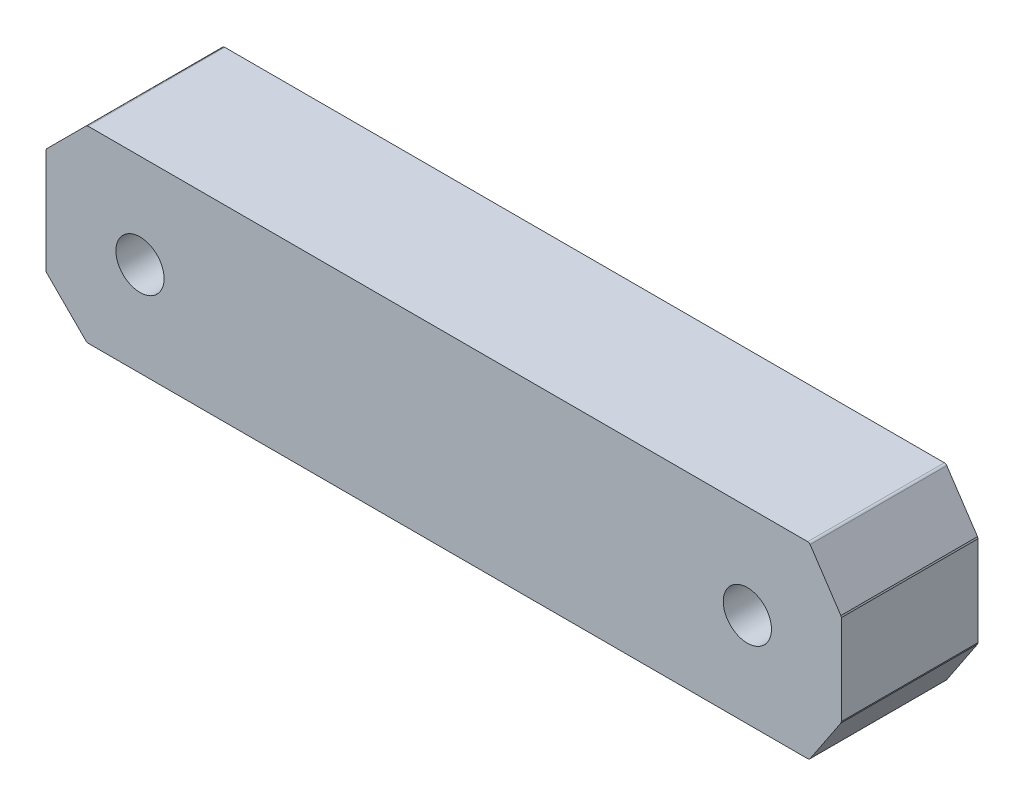
ISO-10303-21;
HEADER;
FILE_DESCRIPTION(('STEP AP214'),'2;1');
FILE_NAME('part.step','',(''),(''),'','','');
FILE_SCHEMA(('AUTOMOTIVE_DESIGN { 1 0 10303 214 1 1 1 1 }'));
ENDSEC;
DATA;
#1=APPLICATION_CONTEXT('core data for automotive mechanical design processes');
#2=APPLICATION_PROTOCOL_DEFINITION('international standard','automotive_design',2000,#1);
#3=PRODUCT_CONTEXT('',#1,'mechanical');
#4=PRODUCT('Part','Part','',(#3));
#5=PRODUCT_RELATED_PRODUCT_CATEGORY('part','',(#4));
#6=PRODUCT_DEFINITION_FORMATION('','',#4);
#7=PRODUCT_DEFINITION_CONTEXT('part definition',#1,'design');
#8=PRODUCT_DEFINITION('design','',#6,#7);
#9=PRODUCT_DEFINITION_SHAPE('','',#8);
#10=(LENGTH_UNIT() NAMED_UNIT(*) SI_UNIT(.MILLI.,.METRE.));
#11=(NAMED_UNIT(*) PLANE_ANGLE_UNIT() SI_UNIT($,.RADIAN.));
#12=(NAMED_UNIT(*) SI_UNIT($,.STERADIAN.) SOLID_ANGLE_UNIT());
#13=UNCERTAINTY_MEASURE_WITH_UNIT(LENGTH_MEASURE(1.E-05),#10,'distance_accuracy_value','');
#14=(GEOMETRIC_REPRESENTATION_CONTEXT(3) GLOBAL_UNCERTAINTY_ASSIGNED_CONTEXT((#13)) GLOBAL_UNIT_ASSIGNED_CONTEXT((#10,
#11,#12)) REPRESENTATION_CONTEXT('',''));
#15=CARTESIAN_POINT('',(0.,0.,0.));
#16=DIRECTION('',(0.,0.,1.));
#17=DIRECTION('',(1.,0.,0.));
#18=AXIS2_PLACEMENT_3D('',#15,#16,#17);
#19=CARTESIAN_POINT('',(-24.588730162779,-6.29999999999995,9.45));
#20=DIRECTION('',(0.,0.,1.));
#21=DIRECTION('',(1.,0.,0.));
#22=AXIS2_PLACEMENT_3D('',#19,#20,#21);
#23=PLANE('',#22);
#24=CARTESIAN_POINT('',(20.9999999999963,1.73120384385851E-12,9.45));
#25=DIRECTION('',(0.,0.,1.));
#26=DIRECTION('',(1.,0.,0.));
#27=AXIS2_PLACEMENT_3D('',#24,#25,#26);
#28=CIRCLE('',#27,1.666);
#29=CARTESIAN_POINT('',(22.6659999999963,1.73120384385851E-12,9.45));
#30=VERTEX_POINT('',#29);
#31=EDGE_CURVE('E182',#30,#30,#28,.T.);
#32=ORIENTED_EDGE('',*,*,#31,.F.);
#33=EDGE_LOOP('',(#32));
#34=FACE_BOUND('',#33,.T.);
#35=CARTESIAN_POINT('',(-24.588730162779,-6.29999999999995,9.45));
#36=DIRECTION('',(0.,0.,1.));
#37=DIRECTION('',(1.,0.,0.));
#38=AXIS2_PLACEMENT_3D('',#35,#36,#37);
#39=CIRCLE('',#38,0.200000000000001);
#40=CARTESIAN_POINT('',(-24.7301515190163,-6.44142135623726,9.45));
#41=VERTEX_POINT('',#40);
#42=CARTESIAN_POINT('',(-24.588730162779,-6.49999999999995,9.45));
#43=VERTEX_POINT('',#42);
#44=EDGE_CURVE('E209',#41,#43,#39,.T.);
#45=ORIENTED_EDGE('',*,*,#44,.T.);
#46=DIRECTION('',(1.,0.,0.));
#47=VECTOR('',#46,1.);
#48=CARTESIAN_POINT('',(-24.588730162779,-6.49999999999995,9.45));
#49=LINE('',#48,#47);
#50=CARTESIAN_POINT('',(25.174488320499,-6.49999999999995,9.45));
#51=VERTEX_POINT('',#50);
#52=EDGE_CURVE('E117',#43,#51,#49,.T.);
#53=ORIENTED_EDGE('',*,*,#52,.T.);
#54=CARTESIAN_POINT('',(25.174488320499,-6.29999999999995,9.45));
#55=DIRECTION('',(0.,0.,1.));
#56=DIRECTION('',(1.,0.,0.));
#57=AXIS2_PLACEMENT_3D('',#54,#55,#56);
#58=CIRCLE('',#57,0.2);
#59=CARTESIAN_POINT('',(25.3409096767364,-6.41092309132063,9.45));
#60=VERTEX_POINT('',#59);
#61=EDGE_CURVE('E248',#51,#60,#58,.T.);
#62=ORIENTED_EDGE('',*,*,#61,.T.);
#63=DIRECTION('',(0.554615456603367,0.832106781186549,0.));
#64=VECTOR('',#63,1.);
#65=CARTESIAN_POINT('',(27.4664213562375,-3.22195195655291,9.45));
#66=LINE('',#65,#64);
#67=CARTESIAN_POINT('',(27.4664213562375,-3.22195195655291,9.45));
#68=VERTEX_POINT('',#67);
#69=EDGE_CURVE('E267',#60,#68,#66,.T.);
#70=ORIENTED_EDGE('',*,*,#69,.T.);
#71=DIRECTION('',(0.289735412759155,0.957106781186552,0.));
#72=VECTOR('',#71,1.);
#73=CARTESIAN_POINT('',(27.4664213562375,-3.22195195655291,9.45));
#74=LINE('',#73,#72);
#75=CARTESIAN_POINT('',(27.5000000000002,-3.11102886523224,9.45));
#76=VERTEX_POINT('',#75);
#77=EDGE_CURVE('E264',#68,#76,#74,.T.);
#78=ORIENTED_EDGE('',*,*,#77,.T.);
#79=DIRECTION('',(0.,1.,0.));
#80=VECTOR('',#79,1.);
#81=CARTESIAN_POINT('',(27.5000000000002,3.11102886523233,9.45));
#82=LINE('',#81,#80);
#83=CARTESIAN_POINT('',(27.5000000000002,3.11102886523233,9.45));
#84=VERTEX_POINT('',#83);
#85=EDGE_CURVE('E266',#76,#84,#82,.T.);
#86=ORIENTED_EDGE('',*,*,#85,.T.);
#87=DIRECTION('',(-0.289735412759156,0.957106781186551,0.));
#88=VECTOR('',#87,1.);
#89=CARTESIAN_POINT('',(27.5000000000002,3.11102886523233,9.45));
#90=LINE('',#89,#88);
#91=CARTESIAN_POINT('',(27.4664213562375,3.221951956553,9.45));
#92=VERTEX_POINT('',#91);
#93=EDGE_CURVE('E269',#84,#92,#90,.T.);
#94=ORIENTED_EDGE('',*,*,#93,.T.);
#95=DIRECTION('',(-0.554615456603367,0.832106781186549,0.));
#96=VECTOR('',#95,1.);
#97=CARTESIAN_POINT('',(25.3409096767364,6.41092309132072,9.45));
#98=LINE('',#97,#96);
#99=CARTESIAN_POINT('',(25.3409096767364,6.41092309132072,9.45));
#100=VERTEX_POINT('',#99);
#101=EDGE_CURVE('E275',#92,#100,#98,.T.);
#102=ORIENTED_EDGE('',*,*,#101,.T.);
#103=CARTESIAN_POINT('',(25.174488320499,6.30000000000005,9.45));
#104=DIRECTION('',(0.,0.,1.));
#105=DIRECTION('',(1.,0.,0.));
#106=AXIS2_PLACEMENT_3D('',#103,#104,#105);
#107=CIRCLE('',#106,0.2);
#108=CARTESIAN_POINT('',(25.174488320499,6.50000000000005,9.45));
#109=VERTEX_POINT('',#108);
#110=EDGE_CURVE('E277',#100,#109,#107,.T.);
#111=ORIENTED_EDGE('',*,*,#110,.T.);
#112=DIRECTION('',(-1.,0.,0.));
#113=VECTOR('',#112,1.);
#114=CARTESIAN_POINT('',(25.174488320499,6.50000000000005,9.45));
#115=LINE('',#114,#113);
#116=CARTESIAN_POINT('',(-24.588730162779,6.50000000000005,9.45));
#117=VERTEX_POINT('',#116);
#118=EDGE_CURVE('E279',#109,#117,#115,.T.);
#119=ORIENTED_EDGE('',*,*,#118,.T.);
#120=CARTESIAN_POINT('',(-24.588730162779,6.30000000000005,9.45));
#121=DIRECTION('',(0.,0.,1.));
#122=DIRECTION('',(1.,0.,0.));
#123=AXIS2_PLACEMENT_3D('',#120,#121,#122);
#124=CIRCLE('',#123,0.2);
#125=CARTESIAN_POINT('',(-24.7301515190163,6.44142135623736,9.45));
#126=VERTEX_POINT('',#125);
#127=EDGE_CURVE('E281',#117,#126,#124,.T.);
#128=ORIENTED_EDGE('',*,*,#127,.T.);
#129=DIRECTION('',(-0.707106781186545,-0.70710678118655,0.));
#130=VECTOR('',#129,1.);
#131=CARTESIAN_POINT('',(-27.4414213562371,3.73015151901653,9.45));
#132=LINE('',#131,#130);
#133=CARTESIAN_POINT('',(-27.4414213562371,3.73015151901653,9.45));
#134=VERTEX_POINT('',#133);
#135=EDGE_CURVE('E283',#126,#134,#132,.T.);
#136=ORIENTED_EDGE('',*,*,#135,.T.);
#137=CARTESIAN_POINT('',(-27.2999999999998,3.58873016277922,9.45));
#138=DIRECTION('',(0.,0.,1.));
#139=DIRECTION('',(1.,0.,0.));
#140=AXIS2_PLACEMENT_3D('',#137,#138,#139);
#141=CIRCLE('',#140,0.199999999999999);
#142=CARTESIAN_POINT('',(-27.4999999999998,3.58873016277923,9.45));
#143=VERTEX_POINT('',#142);
#144=EDGE_CURVE('E160',#134,#143,#141,.T.);
#145=ORIENTED_EDGE('',*,*,#144,.T.);
#146=DIRECTION('',(0.,-1.,0.));
#147=VECTOR('',#146,1.);
#148=CARTESIAN_POINT('',(-27.4999999999998,-3.58873016277913,9.45));
#149=LINE('',#148,#147);
#150=CARTESIAN_POINT('',(-27.4999999999998,-3.58873016277913,9.45));
#151=VERTEX_POINT('',#150);
#152=EDGE_CURVE('E154',#143,#151,#149,.T.);
#153=ORIENTED_EDGE('',*,*,#152,.T.);
#154=CARTESIAN_POINT('',(-27.2999999999998,-3.58873016277913,9.45));
#155=DIRECTION('',(0.,0.,1.));
#156=DIRECTION('',(1.,0.,0.));
#157=AXIS2_PLACEMENT_3D('',#154,#155,#156);
#158=CIRCLE('',#157,0.199999999999999);
#159=CARTESIAN_POINT('',(-27.4414213562371,-3.73015151901644,9.45));
#160=VERTEX_POINT('',#159);
#161=EDGE_CURVE('E158',#151,#160,#158,.T.);
#162=ORIENTED_EDGE('',*,*,#161,.T.);
#163=DIRECTION('',(0.707106781186545,-0.70710678118655,0.));
#164=VECTOR('',#163,1.);
#165=CARTESIAN_POINT('',(-24.7301515190163,-6.44142135623726,9.45));
#166=LINE('',#165,#164);
#167=EDGE_CURVE('E50',#160,#41,#166,.T.);
#168=ORIENTED_EDGE('',*,*,#167,.T.);
#169=EDGE_LOOP('',(#45,#53,#62,#70,#78,#86,#94,#102,#111,#119,#128,#136,#145,#153,#162,#168));
#170=FACE_BOUND('',#169,.T.);
#171=CARTESIAN_POINT('',(-21.0000000000037,1.23160348277719E-12,9.45));
#172=DIRECTION('',(0.,0.,1.));
#173=DIRECTION('',(1.,0.,0.));
#174=AXIS2_PLACEMENT_3D('',#171,#172,#173);
#175=CIRCLE('',#174,1.66600000000001);
#176=CARTESIAN_POINT('',(-19.3340000000037,1.23160348277719E-12,9.45));
#177=VERTEX_POINT('',#176);
#178=EDGE_CURVE('E325',#177,#177,#175,.T.);
#179=ORIENTED_EDGE('',*,*,#178,.F.);
#180=EDGE_LOOP('',(#179));
#181=FACE_BOUND('',#180,.T.);
#182=ADVANCED_FACE('F33',(#34,#170,#181),#23,.T.);
#183=CARTESIAN_POINT('',(-24.588730162779,-6.3,0.));
#184=DIRECTION('',(0.,0.,1.));
#185=DIRECTION('',(1.,0.,0.));
#186=AXIS2_PLACEMENT_3D('',#183,#184,#185);
#187=PLANE('',#186);
#188=CARTESIAN_POINT('',(-24.588730162779,-6.3,0.));
#189=DIRECTION('',(0.,0.,1.));
#190=DIRECTION('',(1.,0.,0.));
#191=AXIS2_PLACEMENT_3D('',#188,#189,#190);
#192=CIRCLE('',#191,0.200000000000001);
#193=CARTESIAN_POINT('',(-24.7301515190163,-6.44142135623731,0.));
#194=VERTEX_POINT('',#193);
#195=CARTESIAN_POINT('',(-24.588730162779,-6.5,0.));
#196=VERTEX_POINT('',#195);
#197=EDGE_CURVE('E178',#194,#196,#192,.T.);
#198=ORIENTED_EDGE('',*,*,#197,.F.);
#199=DIRECTION('',(0.707106781186545,-0.70710678118655,0.));
#200=VECTOR('',#199,1.);
#201=CARTESIAN_POINT('',(-24.7301515190163,-6.44142135623731,0.));
#202=LINE('',#201,#200);
#203=CARTESIAN_POINT('',(-27.4414213562371,-3.73015151901649,0.));
#204=VERTEX_POINT('',#203);
#205=EDGE_CURVE('E109',#204,#194,#202,.T.);
#206=ORIENTED_EDGE('',*,*,#205,.F.);
#207=CARTESIAN_POINT('',(-27.2999999999998,-3.58873016277918,0.));
#208=DIRECTION('',(0.,0.,1.));
#209=DIRECTION('',(1.,0.,0.));
#210=AXIS2_PLACEMENT_3D('',#207,#208,#209);
#211=CIRCLE('',#210,0.199999999999999);
#212=CARTESIAN_POINT('',(-27.4999999999998,-3.58873016277918,0.));
#213=VERTEX_POINT('',#212);
#214=EDGE_CURVE('E103',#213,#204,#211,.T.);
#215=ORIENTED_EDGE('',*,*,#214,.F.);
#216=DIRECTION('',(0.,-1.,0.));
#217=VECTOR('',#216,1.);
#218=CARTESIAN_POINT('',(-27.4999999999998,-3.58873016277918,0.));
#219=LINE('',#218,#217);
#220=CARTESIAN_POINT('',(-27.4999999999998,3.58873016277918,0.));
#221=VERTEX_POINT('',#220);
#222=EDGE_CURVE('E168',#221,#213,#219,.T.);
#223=ORIENTED_EDGE('',*,*,#222,.F.);
#224=CARTESIAN_POINT('',(-27.2999999999998,3.58873016277918,0.));
#225=DIRECTION('',(0.,0.,1.));
#226=DIRECTION('',(1.,0.,0.));
#227=AXIS2_PLACEMENT_3D('',#224,#225,#226);
#228=CIRCLE('',#227,0.199999999999999);
#229=CARTESIAN_POINT('',(-27.4414213562371,3.73015151901648,0.));
#230=VERTEX_POINT('',#229);
#231=EDGE_CURVE('E204',#230,#221,#228,.T.);
#232=ORIENTED_EDGE('',*,*,#231,.F.);
#233=DIRECTION('',(-0.707106781186545,-0.70710678118655,0.));
#234=VECTOR('',#233,1.);
#235=CARTESIAN_POINT('',(-27.4414213562371,3.73015151901648,0.));
#236=LINE('',#235,#234);
#237=CARTESIAN_POINT('',(-24.7301515190163,6.44142135623731,0.));
#238=VERTEX_POINT('',#237);
#239=EDGE_CURVE('E202',#238,#230,#236,.T.);
#240=ORIENTED_EDGE('',*,*,#239,.F.);
#241=CARTESIAN_POINT('',(-24.588730162779,6.3,0.));
#242=DIRECTION('',(0.,0.,1.));
#243=DIRECTION('',(1.,0.,0.));
#244=AXIS2_PLACEMENT_3D('',#241,#242,#243);
#245=CIRCLE('',#244,0.2);
#246=CARTESIAN_POINT('',(-24.588730162779,6.5,0.));
#247=VERTEX_POINT('',#246);
#248=EDGE_CURVE('E200',#247,#238,#245,.T.);
#249=ORIENTED_EDGE('',*,*,#248,.F.);
#250=DIRECTION('',(-1.,0.,0.));
#251=VECTOR('',#250,1.);
#252=CARTESIAN_POINT('',(25.174488320499,6.5,0.));
#253=LINE('',#252,#251);
#254=CARTESIAN_POINT('',(25.174488320499,6.5,0.));
#255=VERTEX_POINT('',#254);
#256=EDGE_CURVE('E198',#255,#247,#253,.T.);
#257=ORIENTED_EDGE('',*,*,#256,.F.);
#258=CARTESIAN_POINT('',(25.174488320499,6.3,0.));
#259=DIRECTION('',(0.,0.,1.));
#260=DIRECTION('',(1.,0.,0.));
#261=AXIS2_PLACEMENT_3D('',#258,#259,#260);
#262=CIRCLE('',#261,0.2);
#263=CARTESIAN_POINT('',(25.3409096767364,6.41092309132067,0.));
#264=VERTEX_POINT('',#263);
#265=EDGE_CURVE('E196',#264,#255,#262,.T.);
#266=ORIENTED_EDGE('',*,*,#265,.F.);
#267=DIRECTION('',(-0.554615456603367,0.832106781186549,0.));
#268=VECTOR('',#267,1.);
#269=CARTESIAN_POINT('',(25.3409096767364,6.41092309132067,0.));
#270=LINE('',#269,#268);
#271=CARTESIAN_POINT('',(27.4664213562376,3.22195195655296,0.));
#272=VERTEX_POINT('',#271);
#273=EDGE_CURVE('E194',#272,#264,#270,.T.);
#274=ORIENTED_EDGE('',*,*,#273,.F.);
#275=DIRECTION('',(-0.289735412759156,0.957106781186551,0.));
#276=VECTOR('',#275,1.);
#277=CARTESIAN_POINT('',(27.5000000000002,3.11102886523228,0.));
#278=LINE('',#277,#276);
#279=CARTESIAN_POINT('',(27.5000000000002,3.11102886523228,0.));
#280=VERTEX_POINT('',#279);
#281=EDGE_CURVE('E192',#280,#272,#278,.T.);
#282=ORIENTED_EDGE('',*,*,#281,.F.);
#283=DIRECTION('',(0.,1.,0.));
#284=VECTOR('',#283,1.);
#285=CARTESIAN_POINT('',(27.5000000000002,3.11102886523228,0.));
#286=LINE('',#285,#284);
#287=CARTESIAN_POINT('',(27.5000000000002,-3.11102886523228,0.));
#288=VERTEX_POINT('',#287);
#289=EDGE_CURVE('E190',#288,#280,#286,.T.);
#290=ORIENTED_EDGE('',*,*,#289,.F.);
#291=DIRECTION('',(0.289735412759155,0.957106781186552,0.));
#292=VECTOR('',#291,1.);
#293=CARTESIAN_POINT('',(27.4664213562376,-3.22195195655296,0.));
#294=LINE('',#293,#292);
#295=CARTESIAN_POINT('',(27.4664213562376,-3.22195195655296,0.));
#296=VERTEX_POINT('',#295);
#297=EDGE_CURVE('E188',#296,#288,#294,.T.);
#298=ORIENTED_EDGE('',*,*,#297,.F.);
#299=DIRECTION('',(0.554615456603367,0.832106781186549,0.));
#300=VECTOR('',#299,1.);
#301=CARTESIAN_POINT('',(27.4664213562376,-3.22195195655296,0.));
#302=LINE('',#301,#300);
#303=CARTESIAN_POINT('',(25.3409096767364,-6.41092309132067,0.));
#304=VERTEX_POINT('',#303);
#305=EDGE_CURVE('E186',#304,#296,#302,.T.);
#306=ORIENTED_EDGE('',*,*,#305,.F.);
#307=CARTESIAN_POINT('',(25.174488320499,-6.3,0.));
#308=DIRECTION('',(0.,0.,1.));
#309=DIRECTION('',(1.,0.,0.));
#310=AXIS2_PLACEMENT_3D('',#307,#308,#309);
#311=CIRCLE('',#310,0.2);
#312=CARTESIAN_POINT('',(25.174488320499,-6.5,0.));
#313=VERTEX_POINT('',#312);
#314=EDGE_CURVE('E184',#313,#304,#311,.T.);
#315=ORIENTED_EDGE('',*,*,#314,.F.);
#316=DIRECTION('',(1.,0.,0.));
#317=VECTOR('',#316,1.);
#318=CARTESIAN_POINT('',(-24.588730162779,-6.5,0.));
#319=LINE('',#318,#317);
#320=EDGE_CURVE('E181',#196,#313,#319,.T.);
#321=ORIENTED_EDGE('',*,*,#320,.F.);
#322=EDGE_LOOP('',(#198,#206,#215,#223,#232,#240,#249,#257,#266,#274,#282,#290,#298,#306,#315,#321));
#323=FACE_BOUND('',#322,.T.);
#324=CARTESIAN_POINT('',(20.9999999999963,1.68441649517348E-12,0.));
#325=DIRECTION('',(0.,0.,1.));
#326=DIRECTION('',(1.,0.,0.));
#327=AXIS2_PLACEMENT_3D('',#324,#325,#326);
#328=CIRCLE('',#327,1.666);
#329=CARTESIAN_POINT('',(22.6659999999963,1.68441649517348E-12,0.));
#330=VERTEX_POINT('',#329);
#331=EDGE_CURVE('E331',#330,#330,#328,.T.);
#332=ORIENTED_EDGE('',*,*,#331,.T.);
#333=EDGE_LOOP('',(#332));
#334=FACE_BOUND('',#333,.T.);
#335=CARTESIAN_POINT('',(-21.0000000000037,1.18481613409216E-12,0.));
#336=DIRECTION('',(0.,0.,1.));
#337=DIRECTION('',(1.,0.,0.));
#338=AXIS2_PLACEMENT_3D('',#335,#336,#337);
#339=CIRCLE('',#338,1.66600000000001);
#340=CARTESIAN_POINT('',(-19.3340000000037,1.18481613409216E-12,0.));
#341=VERTEX_POINT('',#340);
#342=EDGE_CURVE('E328',#341,#341,#339,.T.);
#343=ORIENTED_EDGE('',*,*,#342,.T.);
#344=EDGE_LOOP('',(#343));
#345=FACE_BOUND('',#344,.T.);
#346=ADVANCED_FACE('F252',(#323,#334,#345),#187,.F.);
#347=CARTESIAN_POINT('',(-24.588730162779,-6.29999999999995,9.45));
#348=DIRECTION('',(0.,0.,-1.));
#349=DIRECTION('',(0.,1.,0.));
#350=AXIS2_PLACEMENT_3D('',#347,#348,#349);
#351=CYLINDRICAL_SURFACE('',#350,0.200000000000001);
#352=ORIENTED_EDGE('',*,*,#197,.T.);
#353=DIRECTION('',(0.,0.,-1.));
#354=VECTOR('',#353,1.);
#355=CARTESIAN_POINT('',(-24.588730162779,-6.49999999999995,9.45));
#356=LINE('',#355,#354);
#357=EDGE_CURVE('E11',#43,#196,#356,.T.);
#358=ORIENTED_EDGE('',*,*,#357,.F.);
#359=ORIENTED_EDGE('',*,*,#44,.F.);
#360=DIRECTION('',(0.,0.,-1.));
#361=VECTOR('',#360,1.);
#362=CARTESIAN_POINT('',(-24.7301515190163,-6.44142135623726,9.45));
#363=LINE('',#362,#361);
#364=EDGE_CURVE('E174',#41,#194,#363,.T.);
#365=ORIENTED_EDGE('',*,*,#364,.T.);
#366=EDGE_LOOP('',(#352,#358,#359,#365));
#367=FACE_BOUND('',#366,.T.);
#368=ADVANCED_FACE('F35',(#367),#351,.T.);
#369=CARTESIAN_POINT('',(-24.588730162779,-6.49999999999995,9.45));
#370=DIRECTION('',(0.,1.,0.));
#371=DIRECTION('',(0.,0.,1.));
#372=AXIS2_PLACEMENT_3D('',#369,#370,#371);
#373=PLANE('',#372);
#374=ORIENTED_EDGE('',*,*,#320,.T.);
#375=DIRECTION('',(0.,0.,-1.));
#376=VECTOR('',#375,1.);
#377=CARTESIAN_POINT('',(25.174488320499,-6.49999999999995,9.45));
#378=LINE('',#377,#376);
#379=EDGE_CURVE('E42',#51,#313,#378,.T.);
#380=ORIENTED_EDGE('',*,*,#379,.F.);
#381=ORIENTED_EDGE('',*,*,#52,.F.);
#382=ORIENTED_EDGE('',*,*,#357,.T.);
#383=EDGE_LOOP('',(#374,#380,#381,#382));
#384=FACE_BOUND('',#383,.T.);
#385=ADVANCED_FACE('F464',(#384),#373,.F.);
#386=CARTESIAN_POINT('',(25.174488320499,-6.29999999999995,9.45));
#387=DIRECTION('',(0.,0.,-1.));
#388=DIRECTION('',(0.,1.,0.));
#389=AXIS2_PLACEMENT_3D('',#386,#387,#388);
#390=CYLINDRICAL_SURFACE('',#389,0.2);
#391=ORIENTED_EDGE('',*,*,#314,.T.);
#392=DIRECTION('',(0.,0.,-1.));
#393=VECTOR('',#392,1.);
#394=CARTESIAN_POINT('',(25.3409096767364,-6.41092309132063,9.45));
#395=LINE('',#394,#393);
#396=EDGE_CURVE('E240',#60,#304,#395,.T.);
#397=ORIENTED_EDGE('',*,*,#396,.F.);
#398=ORIENTED_EDGE('',*,*,#61,.F.);
#399=ORIENTED_EDGE('',*,*,#379,.T.);
#400=EDGE_LOOP('',(#391,#397,#398,#399));
#401=FACE_BOUND('',#400,.T.);
#402=ADVANCED_FACE('F246',(#401),#390,.T.);
#403=CARTESIAN_POINT('',(27.4664213562375,-3.22195195655291,9.45));
#404=DIRECTION('',(-0.832106781186549,0.554615456603367,0.));
#405=DIRECTION('',(-0.554615456603367,-0.832106781186549,0.));
#406=AXIS2_PLACEMENT_3D('',#403,#404,#405);
#407=PLANE('',#406);
#408=ORIENTED_EDGE('',*,*,#305,.T.);
#409=DIRECTION('',(0.,0.,-1.));
#410=VECTOR('',#409,1.);
#411=CARTESIAN_POINT('',(27.4664213562375,-3.22195195655291,9.45));
#412=LINE('',#411,#410);
#413=EDGE_CURVE('E237',#68,#296,#412,.T.);
#414=ORIENTED_EDGE('',*,*,#413,.F.);
#415=ORIENTED_EDGE('',*,*,#69,.F.);
#416=ORIENTED_EDGE('',*,*,#396,.T.);
#417=EDGE_LOOP('',(#408,#414,#415,#416));
#418=FACE_BOUND('',#417,.T.);
#419=ADVANCED_FACE('F258',(#418),#407,.F.);
#420=CARTESIAN_POINT('',(27.4664213562375,-3.22195195655291,9.45));
#421=DIRECTION('',(-0.957106781186552,0.289735412759155,0.));
#422=DIRECTION('',(-0.289735412759155,-0.957106781186552,0.));
#423=AXIS2_PLACEMENT_3D('',#420,#421,#422);
#424=PLANE('',#423);
#425=ORIENTED_EDGE('',*,*,#297,.T.);
#426=DIRECTION('',(0.,0.,-1.));
#427=VECTOR('',#426,1.);
#428=CARTESIAN_POINT('',(27.5000000000002,-3.11102886523224,9.45));
#429=LINE('',#428,#427);
#430=EDGE_CURVE('E234',#76,#288,#429,.T.);
#431=ORIENTED_EDGE('',*,*,#430,.F.);
#432=ORIENTED_EDGE('',*,*,#77,.F.);
#433=ORIENTED_EDGE('',*,*,#413,.T.);
#434=EDGE_LOOP('',(#425,#431,#432,#433));
#435=FACE_BOUND('',#434,.T.);
#436=ADVANCED_FACE('F262',(#435),#424,.F.);
#437=CARTESIAN_POINT('',(27.5000000000002,3.11102886523233,9.45));
#438=DIRECTION('',(-1.,0.,0.));
#439=DIRECTION('',(0.,0.,1.));
#440=AXIS2_PLACEMENT_3D('',#437,#438,#439);
#441=PLANE('',#440);
#442=ORIENTED_EDGE('',*,*,#289,.T.);
#443=DIRECTION('',(0.,0.,-1.));
#444=VECTOR('',#443,1.);
#445=CARTESIAN_POINT('',(27.5000000000002,3.11102886523233,9.45));
#446=LINE('',#445,#444);
#447=EDGE_CURVE('E231',#84,#280,#446,.T.);
#448=ORIENTED_EDGE('',*,*,#447,.F.);
#449=ORIENTED_EDGE('',*,*,#85,.F.);
#450=ORIENTED_EDGE('',*,*,#430,.T.);
#451=EDGE_LOOP('',(#442,#448,#449,#450));
#452=FACE_BOUND('',#451,.T.);
#453=ADVANCED_FACE('F429',(#452),#441,.F.);
#454=CARTESIAN_POINT('',(27.5000000000002,3.11102886523233,9.45));
#455=DIRECTION('',(-0.957106781186552,-0.289735412759156,0.));
#456=DIRECTION('',(0.289735412759156,-0.957106781186552,0.));
#457=AXIS2_PLACEMENT_3D('',#454,#455,#456);
#458=PLANE('',#457);
#459=ORIENTED_EDGE('',*,*,#281,.T.);
#460=DIRECTION('',(0.,0.,-1.));
#461=VECTOR('',#460,1.);
#462=CARTESIAN_POINT('',(27.4664213562375,3.221951956553,9.45));
#463=LINE('',#462,#461);
#464=EDGE_CURVE('E228',#92,#272,#463,.T.);
#465=ORIENTED_EDGE('',*,*,#464,.F.);
#466=ORIENTED_EDGE('',*,*,#93,.F.);
#467=ORIENTED_EDGE('',*,*,#447,.T.);
#468=EDGE_LOOP('',(#459,#465,#466,#467));
#469=FACE_BOUND('',#468,.T.);
#470=ADVANCED_FACE('F419',(#469),#458,.F.);
#471=CARTESIAN_POINT('',(25.3409096767364,6.41092309132072,9.45));
#472=DIRECTION('',(-0.832106781186549,-0.554615456603367,0.));
#473=DIRECTION('',(0.554615456603367,-0.832106781186549,0.));
#474=AXIS2_PLACEMENT_3D('',#471,#472,#473);
#475=PLANE('',#474);
#476=ORIENTED_EDGE('',*,*,#273,.T.);
#477=DIRECTION('',(0.,0.,-1.));
#478=VECTOR('',#477,1.);
#479=CARTESIAN_POINT('',(25.3409096767364,6.41092309132072,9.45));
#480=LINE('',#479,#478);
#481=EDGE_CURVE('E225',#100,#264,#480,.T.);
#482=ORIENTED_EDGE('',*,*,#481,.F.);
#483=ORIENTED_EDGE('',*,*,#101,.F.);
#484=ORIENTED_EDGE('',*,*,#464,.T.);
#485=EDGE_LOOP('',(#476,#482,#483,#484));
#486=FACE_BOUND('',#485,.T.);
#487=ADVANCED_FACE('F409',(#486),#475,.F.);
#488=CARTESIAN_POINT('',(25.174488320499,6.30000000000005,9.45));
#489=DIRECTION('',(0.,0.,-1.));
#490=DIRECTION('',(0.,1.,0.));
#491=AXIS2_PLACEMENT_3D('',#488,#489,#490);
#492=CYLINDRICAL_SURFACE('',#491,0.2);
#493=ORIENTED_EDGE('',*,*,#265,.T.);
#494=DIRECTION('',(0.,0.,-1.));
#495=VECTOR('',#494,1.);
#496=CARTESIAN_POINT('',(25.174488320499,6.50000000000005,9.45));
#497=LINE('',#496,#495);
#498=EDGE_CURVE('E222',#109,#255,#497,.T.);
#499=ORIENTED_EDGE('',*,*,#498,.F.);
#500=ORIENTED_EDGE('',*,*,#110,.F.);
#501=ORIENTED_EDGE('',*,*,#481,.T.);
#502=EDGE_LOOP('',(#493,#499,#500,#501));
#503=FACE_BOUND('',#502,.T.);
#504=ADVANCED_FACE('F399',(#503),#492,.T.);
#505=CARTESIAN_POINT('',(25.174488320499,6.50000000000005,9.45));
#506=DIRECTION('',(0.,-1.,0.));
#507=DIRECTION('',(0.,0.,-1.));
#508=AXIS2_PLACEMENT_3D('',#505,#506,#507);
#509=PLANE('',#508);
#510=ORIENTED_EDGE('',*,*,#256,.T.);
#511=DIRECTION('',(0.,0.,-1.));
#512=VECTOR('',#511,1.);
#513=CARTESIAN_POINT('',(-24.588730162779,6.50000000000005,9.45));
#514=LINE('',#513,#512);
#515=EDGE_CURVE('E219',#117,#247,#514,.T.);
#516=ORIENTED_EDGE('',*,*,#515,.F.);
#517=ORIENTED_EDGE('',*,*,#118,.F.);
#518=ORIENTED_EDGE('',*,*,#498,.T.);
#519=EDGE_LOOP('',(#510,#516,#517,#518));
#520=FACE_BOUND('',#519,.T.);
#521=ADVANCED_FACE('F389',(#520),#509,.F.);
#522=CARTESIAN_POINT('',(-24.588730162779,6.30000000000005,9.45));
#523=DIRECTION('',(0.,0.,-1.));
#524=DIRECTION('',(0.,1.,0.));
#525=AXIS2_PLACEMENT_3D('',#522,#523,#524);
#526=CYLINDRICAL_SURFACE('',#525,0.2);
#527=ORIENTED_EDGE('',*,*,#248,.T.);
#528=DIRECTION('',(0.,0.,-1.));
#529=VECTOR('',#528,1.);
#530=CARTESIAN_POINT('',(-24.7301515190163,6.44142135623736,9.45));
#531=LINE('',#530,#529);
#532=EDGE_CURVE('E216',#126,#238,#531,.T.);
#533=ORIENTED_EDGE('',*,*,#532,.F.);
#534=ORIENTED_EDGE('',*,*,#127,.F.);
#535=ORIENTED_EDGE('',*,*,#515,.T.);
#536=EDGE_LOOP('',(#527,#533,#534,#535));
#537=FACE_BOUND('',#536,.T.);
#538=ADVANCED_FACE('F380',(#537),#526,.T.);
#539=CARTESIAN_POINT('',(-27.4414213562371,3.73015151901653,9.45));
#540=DIRECTION('',(0.70710678118655,-0.707106781186545,0.));
#541=DIRECTION('',(0.707106781186545,0.70710678118655,0.));
#542=AXIS2_PLACEMENT_3D('',#539,#540,#541);
#543=PLANE('',#542);
#544=ORIENTED_EDGE('',*,*,#239,.T.);
#545=DIRECTION('',(0.,0.,-1.));
#546=VECTOR('',#545,1.);
#547=CARTESIAN_POINT('',(-27.4414213562371,3.73015151901653,9.45));
#548=LINE('',#547,#546);
#549=EDGE_CURVE('E213',#134,#230,#548,.T.);
#550=ORIENTED_EDGE('',*,*,#549,.F.);
#551=ORIENTED_EDGE('',*,*,#135,.F.);
#552=ORIENTED_EDGE('',*,*,#532,.T.);
#553=EDGE_LOOP('',(#544,#550,#551,#552));
#554=FACE_BOUND('',#553,.T.);
#555=ADVANCED_FACE('F289',(#554),#543,.F.);
#556=CARTESIAN_POINT('',(-27.2999999999998,3.58873016277922,9.45));
#557=DIRECTION('',(0.,0.,-1.));
#558=DIRECTION('',(0.,1.,0.));
#559=AXIS2_PLACEMENT_3D('',#556,#557,#558);
#560=CYLINDRICAL_SURFACE('',#559,0.199999999999999);
#561=ORIENTED_EDGE('',*,*,#231,.T.);
#562=DIRECTION('',(0.,0.,-1.));
#563=VECTOR('',#562,1.);
#564=CARTESIAN_POINT('',(-27.4999999999998,3.58873016277923,9.45));
#565=LINE('',#564,#563);
#566=EDGE_CURVE('E169',#143,#221,#565,.T.);
#567=ORIENTED_EDGE('',*,*,#566,.F.);
#568=ORIENTED_EDGE('',*,*,#144,.F.);
#569=ORIENTED_EDGE('',*,*,#549,.T.);
#570=EDGE_LOOP('',(#561,#567,#568,#569));
#571=FACE_BOUND('',#570,.T.);
#572=ADVANCED_FACE('F293',(#571),#560,.T.);
#573=CARTESIAN_POINT('',(-27.4999999999998,-3.58873016277913,9.45));
#574=DIRECTION('',(1.,0.,0.));
#575=DIRECTION('',(0.,0.,-1.));
#576=AXIS2_PLACEMENT_3D('',#573,#574,#575);
#577=PLANE('',#576);
#578=ORIENTED_EDGE('',*,*,#222,.T.);
#579=DIRECTION('',(0.,0.,-1.));
#580=VECTOR('',#579,1.);
#581=CARTESIAN_POINT('',(-27.4999999999998,-3.58873016277913,9.45));
#582=LINE('',#581,#580);
#583=EDGE_CURVE('E165',#151,#213,#582,.T.);
#584=ORIENTED_EDGE('',*,*,#583,.F.);
#585=ORIENTED_EDGE('',*,*,#152,.F.);
#586=ORIENTED_EDGE('',*,*,#566,.T.);
#587=EDGE_LOOP('',(#578,#584,#585,#586));
#588=FACE_BOUND('',#587,.T.);
#589=ADVANCED_FACE('F166',(#588),#577,.F.);
#590=CARTESIAN_POINT('',(-27.2999999999998,-3.58873016277913,9.45));
#591=DIRECTION('',(0.,0.,-1.));
#592=DIRECTION('',(0.,1.,0.));
#593=AXIS2_PLACEMENT_3D('',#590,#591,#592);
#594=CYLINDRICAL_SURFACE('',#593,0.199999999999999);
#595=ORIENTED_EDGE('',*,*,#214,.T.);
#596=DIRECTION('',(0.,0.,-1.));
#597=VECTOR('',#596,1.);
#598=CARTESIAN_POINT('',(-27.4414213562371,-3.73015151901644,9.45));
#599=LINE('',#598,#597);
#600=EDGE_CURVE('E170',#160,#204,#599,.T.);
#601=ORIENTED_EDGE('',*,*,#600,.F.);
#602=ORIENTED_EDGE('',*,*,#161,.F.);
#603=ORIENTED_EDGE('',*,*,#583,.T.);
#604=EDGE_LOOP('',(#595,#601,#602,#603));
#605=FACE_BOUND('',#604,.T.);
#606=ADVANCED_FACE('F172',(#605),#594,.T.);
#607=CARTESIAN_POINT('',(-24.7301515190163,-6.44142135623726,9.45));
#608=DIRECTION('',(0.70710678118655,0.707106781186545,0.));
#609=DIRECTION('',(-0.707106781186545,0.70710678118655,0.));
#610=AXIS2_PLACEMENT_3D('',#607,#608,#609);
#611=PLANE('',#610);
#612=ORIENTED_EDGE('',*,*,#205,.T.);
#613=ORIENTED_EDGE('',*,*,#364,.F.);
#614=ORIENTED_EDGE('',*,*,#167,.F.);
#615=ORIENTED_EDGE('',*,*,#600,.T.);
#616=EDGE_LOOP('',(#612,#613,#614,#615));
#617=FACE_BOUND('',#616,.T.);
#618=ADVANCED_FACE('F297',(#617),#611,.F.);
#619=CARTESIAN_POINT('',(20.9999999999963,1.73120384385851E-12,9.45));
#620=DIRECTION('',(0.,0.,-1.));
#621=DIRECTION('',(0.,1.,0.));
#622=AXIS2_PLACEMENT_3D('',#619,#620,#621);
#623=CYLINDRICAL_SURFACE('',#622,1.666);
#624=ORIENTED_EDGE('',*,*,#31,.T.);
#625=EDGE_LOOP('',(#624));
#626=FACE_BOUND('',#625,.T.);
#627=ORIENTED_EDGE('',*,*,#331,.F.);
#628=EDGE_LOOP('',(#627));
#629=FACE_BOUND('',#628,.T.);
#630=ADVANCED_FACE('F299',(#626,#629),#623,.F.);
#631=CARTESIAN_POINT('',(-21.0000000000037,1.23160348277719E-12,9.45));
#632=DIRECTION('',(0.,0.,-1.));
#633=DIRECTION('',(0.,1.,0.));
#634=AXIS2_PLACEMENT_3D('',#631,#632,#633);
#635=CYLINDRICAL_SURFACE('',#634,1.66600000000001);
#636=ORIENTED_EDGE('',*,*,#178,.T.);
#637=EDGE_LOOP('',(#636));
#638=FACE_BOUND('',#637,.T.);
#639=ORIENTED_EDGE('',*,*,#342,.F.);
#640=EDGE_LOOP('',(#639));
#641=FACE_BOUND('',#640,.T.);
#642=ADVANCED_FACE('F305',(#638,#641),#635,.F.);
#643=CLOSED_SHELL('',(#182,#346,#368,#385,#402,#419,#436,#453,#470,#487,#504,#521,#538,#555,
#572,#589,#606,#618,#630,#642));
#644=MANIFOLD_SOLID_BREP('B2',#643);
#645=ADVANCED_BREP_SHAPE_REPRESENTATION('',(#18,#644),#14);
#646=SHAPE_DEFINITION_REPRESENTATION(#9,#645);
ENDSEC;
END-ISO-10303-21;
